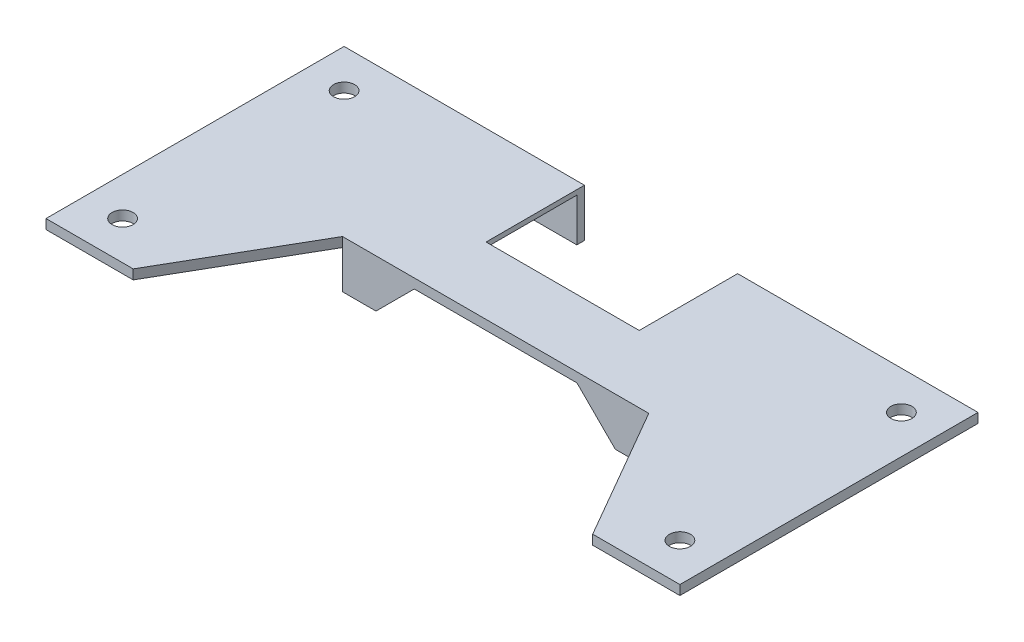
ISO-10303-21;
HEADER;
FILE_DESCRIPTION(('STEP AP214'),'2;1');
FILE_NAME('part.step','',(''),(''),'','','');
FILE_SCHEMA(('AUTOMOTIVE_DESIGN { 1 0 10303 214 1 1 1 1 }'));
ENDSEC;
DATA;
#1=APPLICATION_CONTEXT('core data for automotive mechanical design processes');
#2=APPLICATION_PROTOCOL_DEFINITION('international standard','automotive_design',2000,#1);
#3=PRODUCT_CONTEXT('',#1,'mechanical');
#4=PRODUCT('Part','Part','',(#3));
#5=PRODUCT_RELATED_PRODUCT_CATEGORY('part','',(#4));
#6=PRODUCT_DEFINITION_FORMATION('','',#4);
#7=PRODUCT_DEFINITION_CONTEXT('part definition',#1,'design');
#8=PRODUCT_DEFINITION('design','',#6,#7);
#9=PRODUCT_DEFINITION_SHAPE('','',#8);
#10=(LENGTH_UNIT() NAMED_UNIT(*) SI_UNIT(.MILLI.,.METRE.));
#11=(NAMED_UNIT(*) PLANE_ANGLE_UNIT() SI_UNIT($,.RADIAN.));
#12=(NAMED_UNIT(*) SI_UNIT($,.STERADIAN.) SOLID_ANGLE_UNIT());
#13=UNCERTAINTY_MEASURE_WITH_UNIT(LENGTH_MEASURE(1.E-05),#10,'distance_accuracy_value','');
#14=(GEOMETRIC_REPRESENTATION_CONTEXT(3) GLOBAL_UNCERTAINTY_ASSIGNED_CONTEXT((#13)) GLOBAL_UNIT_ASSIGNED_CONTEXT((#10,
#11,#12)) REPRESENTATION_CONTEXT('',''));
#15=CARTESIAN_POINT('',(0.,0.,0.));
#16=DIRECTION('',(0.,0.,1.));
#17=DIRECTION('',(1.,0.,0.));
#18=AXIS2_PLACEMENT_3D('',#15,#16,#17);
#19=CARTESIAN_POINT('',(8.61002816952043,-4.,0.));
#20=DIRECTION('',(1.,0.,0.));
#21=DIRECTION('',(0.,0.,-1.));
#22=AXIS2_PLACEMENT_3D('',#19,#20,#21);
#23=PLANE('',#22);
#24=DIRECTION('',(0.,0.,-1.));
#25=VECTOR('',#24,1.);
#26=CARTESIAN_POINT('',(8.61002816952043,-4.,0.));
#27=LINE('',#26,#25);
#28=CARTESIAN_POINT('',(8.61002816952043,-4.,8.95537010545894));
#29=VERTEX_POINT('',#28);
#30=CARTESIAN_POINT('',(8.61002816952043,-4.,-8.32462989454106));
#31=VERTEX_POINT('',#30);
#32=EDGE_CURVE('E310',#29,#31,#27,.T.);
#33=ORIENTED_EDGE('',*,*,#32,.T.);
#34=DIRECTION('',(0.,1.,0.));
#35=VECTOR('',#34,1.);
#36=CARTESIAN_POINT('',(8.61002816952043,-12.0399004968967,-8.32462989454106));
#37=LINE('',#36,#35);
#38=CARTESIAN_POINT('',(8.61002816952043,0.,-8.32462989454106));
#39=VERTEX_POINT('',#38);
#40=EDGE_CURVE('E229',#31,#39,#37,.T.);
#41=ORIENTED_EDGE('',*,*,#40,.T.);
#42=DIRECTION('',(0.,0.,1.));
#43=VECTOR('',#42,1.);
#44=CARTESIAN_POINT('',(8.61002816952043,0.,0.));
#45=LINE('',#44,#43);
#46=CARTESIAN_POINT('',(8.61002816952043,0.,8.95537010545894));
#47=VERTEX_POINT('',#46);
#48=EDGE_CURVE('E297',#39,#47,#45,.T.);
#49=ORIENTED_EDGE('',*,*,#48,.T.);
#50=DIRECTION('',(0.,1.,0.));
#51=VECTOR('',#50,1.);
#52=CARTESIAN_POINT('',(8.61002816952043,-4.,8.95537010545894));
#53=LINE('',#52,#51);
#54=EDGE_CURVE('E314',#29,#47,#53,.T.);
#55=ORIENTED_EDGE('',*,*,#54,.F.);
#56=EDGE_LOOP('',(#33,#41,#49,#55));
#57=FACE_BOUND('',#56,.T.);
#58=ADVANCED_FACE('F41',(#57),#23,.T.);
#59=CARTESIAN_POINT('',(-15.3899718304796,-4.,0.));
#60=DIRECTION('',(1.,0.,0.));
#61=DIRECTION('',(0.,0.,-1.));
#62=AXIS2_PLACEMENT_3D('',#59,#60,#61);
#63=PLANE('',#62);
#64=DIRECTION('',(0.,-1.,0.));
#65=VECTOR('',#64,1.);
#66=CARTESIAN_POINT('',(-15.3899718304796,1.,1.95537010545894));
#67=LINE('',#66,#65);
#68=CARTESIAN_POINT('',(-15.3899718304796,1.,1.95537010545894));
#69=VERTEX_POINT('',#68);
#70=CARTESIAN_POINT('',(-15.3899718304796,0.500000000000011,1.95537010545894));
#71=VERTEX_POINT('',#70);
#72=EDGE_CURVE('E329',#69,#71,#67,.T.);
#73=ORIENTED_EDGE('',*,*,#72,.T.);
#74=DIRECTION('',(0.,0.,-1.));
#75=VECTOR('',#74,1.);
#76=CARTESIAN_POINT('',(-15.3899718304796,0.500000000000011,-7.52462989454106));
#77=LINE('',#76,#75);
#78=CARTESIAN_POINT('',(-15.3899718304796,0.500000000000011,-7.52462989454106));
#79=VERTEX_POINT('',#78);
#80=EDGE_CURVE('E426',#71,#79,#77,.T.);
#81=ORIENTED_EDGE('',*,*,#80,.T.);
#82=DIRECTION('',(0.,1.,0.));
#83=VECTOR('',#82,1.);
#84=CARTESIAN_POINT('',(-15.3899718304796,-12.0399004968967,-7.52462989454106));
#85=LINE('',#84,#83);
#86=CARTESIAN_POINT('',(-15.3899718304796,-4.,-7.52462989454106));
#87=VERTEX_POINT('',#86);
#88=EDGE_CURVE('E248',#87,#79,#85,.T.);
#89=ORIENTED_EDGE('',*,*,#88,.F.);
#90=DIRECTION('',(0.,0.,1.));
#91=VECTOR('',#90,1.);
#92=CARTESIAN_POINT('',(-15.3899718304796,-4.,0.));
#93=LINE('',#92,#91);
#94=CARTESIAN_POINT('',(-15.3899718304796,-4.,-8.32462989454106));
#95=VERTEX_POINT('',#94);
#96=EDGE_CURVE('E247',#95,#87,#93,.T.);
#97=ORIENTED_EDGE('',*,*,#96,.F.);
#98=DIRECTION('',(0.,1.,0.));
#99=VECTOR('',#98,1.);
#100=CARTESIAN_POINT('',(-15.3899718304796,-12.0399004968967,-8.32462989454106));
#101=LINE('',#100,#99);
#102=CARTESIAN_POINT('',(-15.3899718304796,1.,-8.32462989454106));
#103=VERTEX_POINT('',#102);
#104=EDGE_CURVE('E242',#95,#103,#101,.T.);
#105=ORIENTED_EDGE('',*,*,#104,.T.);
#106=DIRECTION('',(0.,0.,-1.));
#107=VECTOR('',#106,1.);
#108=CARTESIAN_POINT('',(-15.3899718304796,1.,0.));
#109=LINE('',#108,#107);
#110=EDGE_CURVE('E339',#69,#103,#109,.T.);
#111=ORIENTED_EDGE('',*,*,#110,.F.);
#112=EDGE_LOOP('',(#73,#81,#89,#97,#105,#111));
#113=FACE_BOUND('',#112,.T.);
#114=ADVANCED_FACE('F541',(#113),#63,.T.);
#115=CARTESIAN_POINT('',(-23.3899718304796,1.,0.));
#116=DIRECTION('',(1.,0.,0.));
#117=DIRECTION('',(0.,0.,-1.));
#118=AXIS2_PLACEMENT_3D('',#115,#116,#117);
#119=PLANE('',#118);
#120=DIRECTION('',(0.,0.,1.));
#121=VECTOR('',#120,1.);
#122=CARTESIAN_POINT('',(-23.3899718304796,1.,0.));
#123=LINE('',#122,#121);
#124=CARTESIAN_POINT('',(-23.3899718304796,1.,8.95537010545894));
#125=VERTEX_POINT('',#124);
#126=CARTESIAN_POINT('',(-23.3899718304796,1.,8.95896364490793));
#127=VERTEX_POINT('',#126);
#128=EDGE_CURVE('E358',#125,#127,#123,.T.);
#129=ORIENTED_EDGE('',*,*,#128,.T.);
#130=DIRECTION('',(0.,-1.,0.));
#131=VECTOR('',#130,1.);
#132=CARTESIAN_POINT('',(-23.3899718304796,0.,8.95896364490793));
#133=LINE('',#132,#131);
#134=CARTESIAN_POINT('',(-23.3899718304796,0.,8.95896364490793));
#135=VERTEX_POINT('',#134);
#136=EDGE_CURVE('E448',#127,#135,#133,.T.);
#137=ORIENTED_EDGE('',*,*,#136,.T.);
#138=DIRECTION('',(0.,0.,1.));
#139=VECTOR('',#138,1.);
#140=CARTESIAN_POINT('',(-23.3899718304796,0.,0.));
#141=LINE('',#140,#139);
#142=CARTESIAN_POINT('',(-23.3899718304796,0.,8.95537010545894));
#143=VERTEX_POINT('',#142);
#144=EDGE_CURVE('E381',#143,#135,#141,.T.);
#145=ORIENTED_EDGE('',*,*,#144,.F.);
#146=DIRECTION('',(0.,1.,0.));
#147=VECTOR('',#146,1.);
#148=CARTESIAN_POINT('',(-23.3899718304796,-4.,8.95537010545894));
#149=LINE('',#148,#147);
#150=EDGE_CURVE('E353',#143,#125,#149,.T.);
#151=ORIENTED_EDGE('',*,*,#150,.T.);
#152=EDGE_LOOP('',(#129,#137,#145,#151));
#153=FACE_BOUND('',#152,.T.);
#154=ADVANCED_FACE('F512',(#153),#119,.T.);
#155=CARTESIAN_POINT('',(0.,1.,22.8153701054589));
#156=DIRECTION('',(0.,0.,-1.));
#157=DIRECTION('',(-1.,0.,0.));
#158=AXIS2_PLACEMENT_3D('',#155,#156,#157);
#159=PLANE('',#158);
#160=DIRECTION('',(1.,0.,0.));
#161=VECTOR('',#160,1.);
#162=CARTESIAN_POINT('',(0.,0.,22.8153701054589));
#163=LINE('',#162,#161);
#164=CARTESIAN_POINT('',(-40.4999718304796,0.,22.8153701054589));
#165=VERTEX_POINT('',#164);
#166=CARTESIAN_POINT('',(-31.3899718304796,0.,22.8153701054589));
#167=VERTEX_POINT('',#166);
#168=EDGE_CURVE('E352',#165,#167,#163,.T.);
#169=ORIENTED_EDGE('',*,*,#168,.T.);
#170=DIRECTION('',(0.,1.,0.));
#171=VECTOR('',#170,1.);
#172=CARTESIAN_POINT('',(-31.3899718304796,1.,22.8153701054589));
#173=LINE('',#172,#171);
#174=CARTESIAN_POINT('',(-31.3899718304796,1.,22.8153701054589));
#175=VERTEX_POINT('',#174);
#176=EDGE_CURVE('E455',#167,#175,#173,.T.);
#177=ORIENTED_EDGE('',*,*,#176,.T.);
#178=DIRECTION('',(1.,0.,0.));
#179=VECTOR('',#178,1.);
#180=CARTESIAN_POINT('',(0.,1.,22.8153701054589));
#181=LINE('',#180,#179);
#182=CARTESIAN_POINT('',(-40.4999718304796,1.,22.8153701054589));
#183=VERTEX_POINT('',#182);
#184=EDGE_CURVE('E354',#183,#175,#181,.T.);
#185=ORIENTED_EDGE('',*,*,#184,.F.);
#186=DIRECTION('',(0.,-1.,0.));
#187=VECTOR('',#186,1.);
#188=CARTESIAN_POINT('',(-40.4999718304796,1.,22.8153701054589));
#189=LINE('',#188,#187);
#190=EDGE_CURVE('E377',#183,#165,#189,.T.);
#191=ORIENTED_EDGE('',*,*,#190,.T.);
#192=EDGE_LOOP('',(#169,#177,#185,#191));
#193=FACE_BOUND('',#192,.T.);
#194=ADVANCED_FACE('F563',(#193),#159,.F.);
#195=CARTESIAN_POINT('',(0.,1.,-8.32462989454106));
#196=DIRECTION('',(0.,0.,-1.));
#197=DIRECTION('',(-1.,0.,0.));
#198=AXIS2_PLACEMENT_3D('',#195,#196,#197);
#199=PLANE('',#198);
#200=DIRECTION('',(1.,0.,0.));
#201=VECTOR('',#200,1.);
#202=CARTESIAN_POINT('',(0.,0.,-8.32462989454106));
#203=LINE('',#202,#201);
#204=CARTESIAN_POINT('',(-40.4999718304796,0.,-8.32462989454106));
#205=VERTEX_POINT('',#204);
#206=CARTESIAN_POINT('',(-23.3899718304796,0.,-8.32462989454106));
#207=VERTEX_POINT('',#206);
#208=EDGE_CURVE('E385',#205,#207,#203,.T.);
#209=ORIENTED_EDGE('',*,*,#208,.F.);
#210=DIRECTION('',(0.,-1.,0.));
#211=VECTOR('',#210,1.);
#212=CARTESIAN_POINT('',(-40.4999718304796,1.,-8.32462989454106));
#213=LINE('',#212,#211);
#214=CARTESIAN_POINT('',(-40.4999718304796,1.,-8.32462989454106));
#215=VERTEX_POINT('',#214);
#216=EDGE_CURVE('E401',#215,#205,#213,.T.);
#217=ORIENTED_EDGE('',*,*,#216,.F.);
#218=DIRECTION('',(1.,0.,0.));
#219=VECTOR('',#218,1.);
#220=CARTESIAN_POINT('',(0.,1.,-8.32462989454106));
#221=LINE('',#220,#219);
#222=EDGE_CURVE('E363',#215,#103,#221,.T.);
#223=ORIENTED_EDGE('',*,*,#222,.T.);
#224=ORIENTED_EDGE('',*,*,#104,.F.);
#225=DIRECTION('',(1.,0.,0.));
#226=VECTOR('',#225,1.);
#227=CARTESIAN_POINT('',(0.,-4.,-8.32462989454106));
#228=LINE('',#227,#226);
#229=CARTESIAN_POINT('',(-23.3899718304796,-4.,-8.32462989454106));
#230=VERTEX_POINT('',#229);
#231=EDGE_CURVE('E252',#230,#95,#228,.T.);
#232=ORIENTED_EDGE('',*,*,#231,.F.);
#233=DIRECTION('',(0.,1.,0.));
#234=VECTOR('',#233,1.);
#235=CARTESIAN_POINT('',(-23.3899718304796,-12.0399004968967,-8.32462989454106));
#236=LINE('',#235,#234);
#237=EDGE_CURVE('E256',#230,#207,#236,.T.);
#238=ORIENTED_EDGE('',*,*,#237,.T.);
#239=EDGE_LOOP('',(#209,#217,#223,#224,#232,#238));
#240=FACE_BOUND('',#239,.T.);
#241=ADVANCED_FACE('F532',(#240),#199,.T.);
#242=CARTESIAN_POINT('',(-36.4999718304796,1.,18.8153701054589));
#243=DIRECTION('',(0.,-1.,0.));
#244=DIRECTION('',(0.,0.,-1.));
#245=AXIS2_PLACEMENT_3D('',#242,#243,#244);
#246=CYLINDRICAL_SURFACE('',#245,1.1);
#247=CARTESIAN_POINT('',(-36.4999718304796,1.,18.8153701054589));
#248=DIRECTION('',(0.,1.,0.));
#249=DIRECTION('',(0.,0.,1.));
#250=AXIS2_PLACEMENT_3D('',#247,#248,#249);
#251=CIRCLE('',#250,1.1);
#252=CARTESIAN_POINT('',(-36.4999718304796,1.,19.9153701054589));
#253=VERTEX_POINT('',#252);
#254=EDGE_CURVE('E369',#253,#253,#251,.T.);
#255=ORIENTED_EDGE('',*,*,#254,.T.);
#256=EDGE_LOOP('',(#255));
#257=FACE_BOUND('',#256,.T.);
#258=CARTESIAN_POINT('',(-36.4999718304796,0.,18.8153701054589));
#259=DIRECTION('',(0.,1.,0.));
#260=DIRECTION('',(0.,0.,1.));
#261=AXIS2_PLACEMENT_3D('',#258,#259,#260);
#262=CIRCLE('',#261,1.1);
#263=CARTESIAN_POINT('',(-36.4999718304796,0.,19.9153701054589));
#264=VERTEX_POINT('',#263);
#265=EDGE_CURVE('E391',#264,#264,#262,.T.);
#266=ORIENTED_EDGE('',*,*,#265,.F.);
#267=EDGE_LOOP('',(#266));
#268=FACE_BOUND('',#267,.T.);
#269=ADVANCED_FACE('F570',(#257,#268),#246,.F.);
#270=CARTESIAN_POINT('',(-40.4999718304796,1.,0.));
#271=DIRECTION('',(1.,0.,0.));
#272=DIRECTION('',(0.,0.,-1.));
#273=AXIS2_PLACEMENT_3D('',#270,#271,#272);
#274=PLANE('',#273);
#275=DIRECTION('',(0.,0.,1.));
#276=VECTOR('',#275,1.);
#277=CARTESIAN_POINT('',(-40.4999718304796,0.,0.));
#278=LINE('',#277,#276);
#279=EDGE_CURVE('E388',#205,#165,#278,.T.);
#280=ORIENTED_EDGE('',*,*,#279,.T.);
#281=ORIENTED_EDGE('',*,*,#190,.F.);
#282=DIRECTION('',(0.,0.,1.));
#283=VECTOR('',#282,1.);
#284=CARTESIAN_POINT('',(-40.4999718304796,1.,0.));
#285=LINE('',#284,#283);
#286=EDGE_CURVE('E366',#215,#183,#285,.T.);
#287=ORIENTED_EDGE('',*,*,#286,.F.);
#288=ORIENTED_EDGE('',*,*,#216,.T.);
#289=EDGE_LOOP('',(#280,#281,#287,#288));
#290=FACE_BOUND('',#289,.T.);
#291=ADVANCED_FACE('F561',(#290),#274,.F.);
#292=CARTESIAN_POINT('',(-36.4999718304796,1.,-4.32462989454106));
#293=DIRECTION('',(0.,-1.,0.));
#294=DIRECTION('',(0.,0.,-1.));
#295=AXIS2_PLACEMENT_3D('',#292,#293,#294);
#296=CYLINDRICAL_SURFACE('',#295,1.1);
#297=CARTESIAN_POINT('',(-36.4999718304796,1.,-4.32462989454106));
#298=DIRECTION('',(0.,1.,0.));
#299=DIRECTION('',(0.,0.,1.));
#300=AXIS2_PLACEMENT_3D('',#297,#298,#299);
#301=CIRCLE('',#300,1.1);
#302=CARTESIAN_POINT('',(-36.4999718304796,1.,-3.22462989454106));
#303=VERTEX_POINT('',#302);
#304=EDGE_CURVE('E373',#303,#303,#301,.T.);
#305=ORIENTED_EDGE('',*,*,#304,.T.);
#306=EDGE_LOOP('',(#305));
#307=FACE_BOUND('',#306,.T.);
#308=CARTESIAN_POINT('',(-36.4999718304796,0.,-4.32462989454106));
#309=DIRECTION('',(0.,1.,0.));
#310=DIRECTION('',(0.,0.,1.));
#311=AXIS2_PLACEMENT_3D('',#308,#309,#310);
#312=CIRCLE('',#311,1.1);
#313=CARTESIAN_POINT('',(-36.4999718304796,0.,-3.22462989454106));
#314=VERTEX_POINT('',#313);
#315=EDGE_CURVE('E359',#314,#314,#312,.T.);
#316=ORIENTED_EDGE('',*,*,#315,.F.);
#317=EDGE_LOOP('',(#316));
#318=FACE_BOUND('',#317,.T.);
#319=ADVANCED_FACE('F595',(#307,#318),#296,.F.);
#320=CARTESIAN_POINT('',(0.,1.,0.));
#321=DIRECTION('',(0.,1.,0.));
#322=DIRECTION('',(0.,0.,1.));
#323=AXIS2_PLACEMENT_3D('',#320,#321,#322);
#324=PLANE('',#323);
#325=DIRECTION('',(0.,0.,1.));
#326=VECTOR('',#325,1.);
#327=CARTESIAN_POINT('',(8.61002816952043,1.,0.));
#328=LINE('',#327,#326);
#329=CARTESIAN_POINT('',(8.61002816952043,1.,8.95537010545894));
#330=VERTEX_POINT('',#329);
#331=CARTESIAN_POINT('',(8.61002816952043,1.,8.95896364490793));
#332=VERTEX_POINT('',#331);
#333=EDGE_CURVE('E219',#330,#332,#328,.T.);
#334=ORIENTED_EDGE('',*,*,#333,.T.);
#335=DIRECTION('',(-0.500000000000001,0.,-0.866025403784438));
#336=VECTOR('',#335,1.);
#337=CARTESIAN_POINT('',(2.57817607310457,1.,-1.48851064982518));
#338=LINE('',#337,#336);
#339=CARTESIAN_POINT('',(16.6100281695204,1.,22.8153701054589));
#340=VERTEX_POINT('',#339);
#341=EDGE_CURVE('E11',#332,#340,#338,.F.);
#342=ORIENTED_EDGE('',*,*,#341,.T.);
#343=DIRECTION('',(1.,0.,0.));
#344=VECTOR('',#343,1.);
#345=CARTESIAN_POINT('',(0.,1.,22.8153701054589));
#346=LINE('',#345,#344);
#347=CARTESIAN_POINT('',(25.7200281695204,1.,22.8153701054589));
#348=VERTEX_POINT('',#347);
#349=EDGE_CURVE('E276',#340,#348,#346,.T.);
#350=ORIENTED_EDGE('',*,*,#349,.T.);
#351=DIRECTION('',(0.,0.,1.));
#352=VECTOR('',#351,1.);
#353=CARTESIAN_POINT('',(25.7200281695204,1.,0.));
#354=LINE('',#353,#352);
#355=CARTESIAN_POINT('',(25.7200281695204,1.,-8.32462989454106));
#356=VERTEX_POINT('',#355);
#357=EDGE_CURVE('E216',#356,#348,#354,.T.);
#358=ORIENTED_EDGE('',*,*,#357,.F.);
#359=DIRECTION('',(1.,0.,0.));
#360=VECTOR('',#359,1.);
#361=CARTESIAN_POINT('',(0.,1.,-8.32462989454106));
#362=LINE('',#361,#360);
#363=CARTESIAN_POINT('',(0.610028169520424,1.,-8.32462989454106));
#364=VERTEX_POINT('',#363);
#365=EDGE_CURVE('E212',#364,#356,#362,.T.);
#366=ORIENTED_EDGE('',*,*,#365,.F.);
#367=DIRECTION('',(0.,0.,-1.));
#368=VECTOR('',#367,1.);
#369=CARTESIAN_POINT('',(0.610028169520424,1.,0.));
#370=LINE('',#369,#368);
#371=CARTESIAN_POINT('',(0.610028169520424,1.,1.95537010545894));
#372=VERTEX_POINT('',#371);
#373=EDGE_CURVE('E195',#372,#364,#370,.T.);
#374=ORIENTED_EDGE('',*,*,#373,.F.);
#375=DIRECTION('',(-1.,0.,0.));
#376=VECTOR('',#375,1.);
#377=CARTESIAN_POINT('',(0.,1.,1.95537010545894));
#378=LINE('',#377,#376);
#379=EDGE_CURVE('E319',#372,#69,#378,.T.);
#380=ORIENTED_EDGE('',*,*,#379,.T.);
#381=ORIENTED_EDGE('',*,*,#110,.T.);
#382=ORIENTED_EDGE('',*,*,#222,.F.);
#383=ORIENTED_EDGE('',*,*,#286,.T.);
#384=ORIENTED_EDGE('',*,*,#184,.T.);
#385=DIRECTION('',(0.500000000000001,0.,-0.866025403784438));
#386=VECTOR('',#385,1.);
#387=CARTESIAN_POINT('',(-13.6631338188239,1.,-7.88841398827188));
#388=LINE('',#387,#386);
#389=EDGE_CURVE('E458',#175,#127,#388,.T.);
#390=ORIENTED_EDGE('',*,*,#389,.T.);
#391=ORIENTED_EDGE('',*,*,#128,.F.);
#392=DIRECTION('',(1.,0.,0.));
#393=VECTOR('',#392,1.);
#394=CARTESIAN_POINT('',(0.,1.,8.95537010545894));
#395=LINE('',#394,#393);
#396=EDGE_CURVE('E333',#125,#330,#395,.T.);
#397=ORIENTED_EDGE('',*,*,#396,.T.);
#398=EDGE_LOOP('',(#334,#342,#350,#358,#366,#374,#380,#381,#382,#383,#384,#390,#391,#397));
#399=FACE_BOUND('',#398,.T.);
#400=ORIENTED_EDGE('',*,*,#254,.F.);
#401=EDGE_LOOP('',(#400));
#402=FACE_BOUND('',#401,.T.);
#403=ORIENTED_EDGE('',*,*,#304,.F.);
#404=EDGE_LOOP('',(#403));
#405=FACE_BOUND('',#404,.T.);
#406=CARTESIAN_POINT('',(21.7200281695204,1.,-4.32462989454106));
#407=DIRECTION('',(0.,1.,0.));
#408=DIRECTION('',(0.,0.,1.));
#409=AXIS2_PLACEMENT_3D('',#406,#407,#408);
#410=CIRCLE('',#409,1.1);
#411=CARTESIAN_POINT('',(21.7200281695204,1.,-3.22462989454106));
#412=VERTEX_POINT('',#411);
#413=EDGE_CURVE('E266',#412,#412,#410,.T.);
#414=ORIENTED_EDGE('',*,*,#413,.F.);
#415=EDGE_LOOP('',(#414));
#416=FACE_BOUND('',#415,.T.);
#417=CARTESIAN_POINT('',(21.7200281695204,1.,18.8153701054589));
#418=DIRECTION('',(0.,1.,0.));
#419=DIRECTION('',(0.,0.,1.));
#420=AXIS2_PLACEMENT_3D('',#417,#418,#419);
#421=CIRCLE('',#420,1.1);
#422=CARTESIAN_POINT('',(21.7200281695204,1.,19.9153701054589));
#423=VERTEX_POINT('',#422);
#424=EDGE_CURVE('E220',#423,#423,#421,.T.);
#425=ORIENTED_EDGE('',*,*,#424,.F.);
#426=EDGE_LOOP('',(#425));
#427=FACE_BOUND('',#426,.T.);
#428=ADVANCED_FACE('F213',(#399,#402,#405,#416,#427),#324,.T.);
#429=CARTESIAN_POINT('',(0.,0.,0.));
#430=DIRECTION('',(0.,1.,0.));
#431=DIRECTION('',(0.,0.,1.));
#432=AXIS2_PLACEMENT_3D('',#429,#430,#431);
#433=PLANE('',#432);
#434=ORIENTED_EDGE('',*,*,#144,.T.);
#435=DIRECTION('',(-0.500000000000001,0.,0.866025403784438));
#436=VECTOR('',#435,1.);
#437=CARTESIAN_POINT('',(-23.3899718304796,0.,8.95896364490793));
#438=LINE('',#437,#436);
#439=EDGE_CURVE('E452',#135,#167,#438,.T.);
#440=ORIENTED_EDGE('',*,*,#439,.T.);
#441=ORIENTED_EDGE('',*,*,#168,.F.);
#442=ORIENTED_EDGE('',*,*,#279,.F.);
#443=ORIENTED_EDGE('',*,*,#208,.T.);
#444=EDGE_CURVE('E382',#207,#143,#141,.T.);
#445=ORIENTED_EDGE('',*,*,#444,.T.);
#446=EDGE_LOOP('',(#434,#440,#441,#442,#443,#445));
#447=FACE_BOUND('',#446,.T.);
#448=ORIENTED_EDGE('',*,*,#265,.T.);
#449=EDGE_LOOP('',(#448));
#450=FACE_BOUND('',#449,.T.);
#451=ORIENTED_EDGE('',*,*,#315,.T.);
#452=EDGE_LOOP('',(#451));
#453=FACE_BOUND('',#452,.T.);
#454=ADVANCED_FACE('F520',(#447,#450,#453),#433,.F.);
#455=CARTESIAN_POINT('',(0.,-4.,8.95537010545894));
#456=DIRECTION('',(0.,0.,1.));
#457=DIRECTION('',(1.,0.,0.));
#458=AXIS2_PLACEMENT_3D('',#455,#456,#457);
#459=PLANE('',#458);
#460=DIRECTION('',(0.707106781186549,0.707106781186546,0.));
#461=VECTOR('',#460,1.);
#462=CARTESIAN_POINT('',(-9.94498591523976,5.94498591523979,8.95537010545894));
#463=LINE('',#462,#461);
#464=CARTESIAN_POINT('',(-19.8899718304796,-4.,8.95537010545894));
#465=VERTEX_POINT('',#464);
#466=CARTESIAN_POINT('',(-15.8899718304796,0.,8.95537010545894));
#467=VERTEX_POINT('',#466);
#468=EDGE_CURVE('E437',#465,#467,#463,.T.);
#469=ORIENTED_EDGE('',*,*,#468,.T.);
#470=DIRECTION('',(-1.,0.,0.));
#471=VECTOR('',#470,1.);
#472=CARTESIAN_POINT('',(0.,0.,8.95537010545894));
#473=LINE('',#472,#471);
#474=CARTESIAN_POINT('',(1.11002816952045,0.,8.95537010545894));
#475=VERTEX_POINT('',#474);
#476=EDGE_CURVE('E322',#475,#467,#473,.T.);
#477=ORIENTED_EDGE('',*,*,#476,.F.);
#478=DIRECTION('',(-0.707106781186546,0.707106781186549,0.));
#479=VECTOR('',#478,1.);
#480=CARTESIAN_POINT('',(2.55501408476023,-1.44498591523978,8.95537010545894));
#481=LINE('',#480,#479);
#482=CARTESIAN_POINT('',(5.11002816952043,-4.,8.95537010545894));
#483=VERTEX_POINT('',#482);
#484=EDGE_CURVE('E415',#475,#483,#481,.F.);
#485=ORIENTED_EDGE('',*,*,#484,.T.);
#486=DIRECTION('',(1.,0.,0.));
#487=VECTOR('',#486,1.);
#488=CARTESIAN_POINT('',(0.,-4.,8.95537010545894));
#489=LINE('',#488,#487);
#490=EDGE_CURVE('E207',#483,#29,#489,.T.);
#491=ORIENTED_EDGE('',*,*,#490,.T.);
#492=ORIENTED_EDGE('',*,*,#54,.T.);
#493=EDGE_CURVE('E312',#47,#330,#53,.T.);
#494=ORIENTED_EDGE('',*,*,#493,.T.);
#495=ORIENTED_EDGE('',*,*,#396,.F.);
#496=ORIENTED_EDGE('',*,*,#150,.F.);
#497=CARTESIAN_POINT('',(-23.3899718304796,-4.,8.95537010545894));
#498=VERTEX_POINT('',#497);
#499=EDGE_CURVE('E342',#498,#143,#149,.T.);
#500=ORIENTED_EDGE('',*,*,#499,.F.);
#501=DIRECTION('',(1.,0.,0.));
#502=VECTOR('',#501,1.);
#503=CARTESIAN_POINT('',(0.,-4.,8.95537010545894));
#504=LINE('',#503,#502);
#505=EDGE_CURVE('E334',#498,#465,#504,.T.);
#506=ORIENTED_EDGE('',*,*,#505,.T.);
#507=EDGE_LOOP('',(#469,#477,#485,#491,#492,#494,#495,#496,#500,#506));
#508=FACE_BOUND('',#507,.T.);
#509=ADVANCED_FACE('F493',(#508),#459,.T.);
#510=CARTESIAN_POINT('',(-23.3899718304796,-4.,0.));
#511=DIRECTION('',(1.,0.,0.));
#512=DIRECTION('',(0.,0.,-1.));
#513=AXIS2_PLACEMENT_3D('',#510,#511,#512);
#514=PLANE('',#513);
#515=ORIENTED_EDGE('',*,*,#499,.T.);
#516=ORIENTED_EDGE('',*,*,#444,.F.);
#517=ORIENTED_EDGE('',*,*,#237,.F.);
#518=DIRECTION('',(0.,0.,-1.));
#519=VECTOR('',#518,1.);
#520=CARTESIAN_POINT('',(-23.3899718304796,-4.,0.));
#521=LINE('',#520,#519);
#522=EDGE_CURVE('E338',#498,#230,#521,.T.);
#523=ORIENTED_EDGE('',*,*,#522,.F.);
#524=EDGE_LOOP('',(#515,#516,#517,#523));
#525=FACE_BOUND('',#524,.T.);
#526=ADVANCED_FACE('F528',(#525),#514,.F.);
#527=CARTESIAN_POINT('',(0.,-4.,0.));
#528=DIRECTION('',(0.,1.,0.));
#529=DIRECTION('',(0.,0.,1.));
#530=AXIS2_PLACEMENT_3D('',#527,#528,#529);
#531=PLANE('',#530);
#532=ORIENTED_EDGE('',*,*,#522,.T.);
#533=ORIENTED_EDGE('',*,*,#231,.T.);
#534=ORIENTED_EDGE('',*,*,#96,.T.);
#535=DIRECTION('',(1.,0.,0.));
#536=VECTOR('',#535,1.);
#537=CARTESIAN_POINT('',(0.,-4.,-7.52462989454106));
#538=LINE('',#537,#536);
#539=CARTESIAN_POINT('',(-19.8899718304796,-4.,-7.52462989454106));
#540=VERTEX_POINT('',#539);
#541=EDGE_CURVE('E244',#540,#87,#538,.T.);
#542=ORIENTED_EDGE('',*,*,#541,.F.);
#543=DIRECTION('',(0.,0.,1.));
#544=VECTOR('',#543,1.);
#545=CARTESIAN_POINT('',(-19.8899718304796,-4.,8.95537010545894));
#546=LINE('',#545,#544);
#547=EDGE_CURVE('E434',#540,#465,#546,.T.);
#548=ORIENTED_EDGE('',*,*,#547,.T.);
#549=ORIENTED_EDGE('',*,*,#505,.F.);
#550=EDGE_LOOP('',(#532,#533,#534,#542,#548,#549));
#551=FACE_BOUND('',#550,.T.);
#552=ADVANCED_FACE('F536',(#551),#531,.F.);
#553=CARTESIAN_POINT('',(0.,1.,1.95537010545894));
#554=DIRECTION('',(0.,0.,1.));
#555=DIRECTION('',(1.,0.,0.));
#556=AXIS2_PLACEMENT_3D('',#553,#554,#555);
#557=PLANE('',#556);
#558=DIRECTION('',(-1.,0.,0.));
#559=VECTOR('',#558,1.);
#560=CARTESIAN_POINT('',(0.,0.,1.95537010545894));
#561=LINE('',#560,#559);
#562=CARTESIAN_POINT('',(1.11002816952045,0.,1.95537010545894));
#563=VERTEX_POINT('',#562);
#564=CARTESIAN_POINT('',(-15.8899718304796,0.,1.95537010545894));
#565=VERTEX_POINT('',#564);
#566=EDGE_CURVE('E318',#563,#565,#561,.T.);
#567=ORIENTED_EDGE('',*,*,#566,.T.);
#568=DIRECTION('',(0.707106781186549,0.707106781186546,0.));
#569=VECTOR('',#568,1.);
#570=CARTESIAN_POINT('',(-7.44498591523976,8.44498591523979,1.95537010545894));
#571=LINE('',#570,#569);
#572=EDGE_CURVE('E445',#565,#71,#571,.T.);
#573=ORIENTED_EDGE('',*,*,#572,.T.);
#574=ORIENTED_EDGE('',*,*,#72,.F.);
#575=ORIENTED_EDGE('',*,*,#379,.F.);
#576=DIRECTION('',(0.,-1.,0.));
#577=VECTOR('',#576,1.);
#578=CARTESIAN_POINT('',(0.610028169520424,1.,1.95537010545894));
#579=LINE('',#578,#577);
#580=CARTESIAN_POINT('',(0.610028169520424,0.500000000000026,1.95537010545894));
#581=VERTEX_POINT('',#580);
#582=EDGE_CURVE('E203',#372,#581,#579,.T.);
#583=ORIENTED_EDGE('',*,*,#582,.T.);
#584=DIRECTION('',(-0.707106781186546,0.707106781186549,0.));
#585=VECTOR('',#584,1.);
#586=CARTESIAN_POINT('',(0.0550140847602257,1.05501408476023,1.95537010545894));
#587=LINE('',#586,#585);
#588=EDGE_CURVE('E418',#581,#563,#587,.F.);
#589=ORIENTED_EDGE('',*,*,#588,.T.);
#590=EDGE_LOOP('',(#567,#573,#574,#575,#583,#589));
#591=FACE_BOUND('',#590,.T.);
#592=ADVANCED_FACE('F555',(#591),#557,.F.);
#593=CARTESIAN_POINT('',(0.,0.,0.));
#594=DIRECTION('',(0.,1.,0.));
#595=DIRECTION('',(0.,0.,1.));
#596=AXIS2_PLACEMENT_3D('',#593,#594,#595);
#597=PLANE('',#596);
#598=ORIENTED_EDGE('',*,*,#566,.F.);
#599=DIRECTION('',(0.,0.,-1.));
#600=VECTOR('',#599,1.);
#601=CARTESIAN_POINT('',(1.11002816952045,0.,0.));
#602=LINE('',#601,#600);
#603=EDGE_CURVE('E422',#563,#475,#602,.F.);
#604=ORIENTED_EDGE('',*,*,#603,.T.);
#605=ORIENTED_EDGE('',*,*,#476,.T.);
#606=DIRECTION('',(0.,0.,-1.));
#607=VECTOR('',#606,1.);
#608=CARTESIAN_POINT('',(-15.8899718304796,0.,0.));
#609=LINE('',#608,#607);
#610=EDGE_CURVE('E441',#467,#565,#609,.T.);
#611=ORIENTED_EDGE('',*,*,#610,.T.);
#612=EDGE_LOOP('',(#598,#604,#605,#611));
#613=FACE_BOUND('',#612,.T.);
#614=ADVANCED_FACE('F552',(#613),#597,.F.);
#615=CARTESIAN_POINT('',(0.610028169520424,-4.,0.));
#616=DIRECTION('',(1.,0.,0.));
#617=DIRECTION('',(0.,0.,-1.));
#618=AXIS2_PLACEMENT_3D('',#615,#616,#617);
#619=PLANE('',#618);
#620=ORIENTED_EDGE('',*,*,#373,.T.);
#621=DIRECTION('',(0.,1.,0.));
#622=VECTOR('',#621,1.);
#623=CARTESIAN_POINT('',(0.610028169520424,-12.0399004968967,-8.32462989454106));
#624=LINE('',#623,#622);
#625=CARTESIAN_POINT('',(0.610028169520424,-4.,-8.32462989454106));
#626=VERTEX_POINT('',#625);
#627=EDGE_CURVE('E200',#626,#364,#624,.T.);
#628=ORIENTED_EDGE('',*,*,#627,.F.);
#629=DIRECTION('',(0.,0.,1.));
#630=VECTOR('',#629,1.);
#631=CARTESIAN_POINT('',(0.610028169520424,-4.,0.));
#632=LINE('',#631,#630);
#633=CARTESIAN_POINT('',(0.610028169520424,-4.,-7.52462989454106));
#634=VERTEX_POINT('',#633);
#635=EDGE_CURVE('E234',#626,#634,#632,.T.);
#636=ORIENTED_EDGE('',*,*,#635,.T.);
#637=DIRECTION('',(0.,1.,0.));
#638=VECTOR('',#637,1.);
#639=CARTESIAN_POINT('',(0.610028169520425,-12.0399004968967,-7.52462989454106));
#640=LINE('',#639,#638);
#641=CARTESIAN_POINT('',(0.610028169520425,0.500000000000022,-7.52462989454106));
#642=VERTEX_POINT('',#641);
#643=EDGE_CURVE('E228',#634,#642,#640,.T.);
#644=ORIENTED_EDGE('',*,*,#643,.T.);
#645=DIRECTION('',(0.,0.,1.));
#646=VECTOR('',#645,1.);
#647=CARTESIAN_POINT('',(0.610028169520424,0.500000000000026,0.));
#648=LINE('',#647,#646);
#649=EDGE_CURVE('E412',#642,#581,#648,.T.);
#650=ORIENTED_EDGE('',*,*,#649,.T.);
#651=ORIENTED_EDGE('',*,*,#582,.F.);
#652=EDGE_LOOP('',(#620,#628,#636,#644,#650,#651));
#653=FACE_BOUND('',#652,.T.);
#654=ADVANCED_FACE('F197',(#653),#619,.F.);
#655=CARTESIAN_POINT('',(0.,-4.,0.));
#656=DIRECTION('',(0.,1.,0.));
#657=DIRECTION('',(0.,0.,1.));
#658=AXIS2_PLACEMENT_3D('',#655,#656,#657);
#659=PLANE('',#658);
#660=ORIENTED_EDGE('',*,*,#490,.F.);
#661=DIRECTION('',(0.,0.,-1.));
#662=VECTOR('',#661,1.);
#663=CARTESIAN_POINT('',(5.11002816952043,-4.,0.));
#664=LINE('',#663,#662);
#665=CARTESIAN_POINT('',(5.11002816952043,-4.,-7.52462989454107));
#666=VERTEX_POINT('',#665);
#667=EDGE_CURVE('E404',#483,#666,#664,.T.);
#668=ORIENTED_EDGE('',*,*,#667,.T.);
#669=DIRECTION('',(1.,0.,0.));
#670=VECTOR('',#669,1.);
#671=CARTESIAN_POINT('',(0.,-4.,-7.52462989454106));
#672=LINE('',#671,#670);
#673=EDGE_CURVE('E243',#634,#666,#672,.T.);
#674=ORIENTED_EDGE('',*,*,#673,.F.);
#675=ORIENTED_EDGE('',*,*,#635,.F.);
#676=DIRECTION('',(1.,0.,0.));
#677=VECTOR('',#676,1.);
#678=CARTESIAN_POINT('',(0.,-4.,-8.32462989454106));
#679=LINE('',#678,#677);
#680=EDGE_CURVE('E226',#626,#31,#679,.T.);
#681=ORIENTED_EDGE('',*,*,#680,.T.);
#682=ORIENTED_EDGE('',*,*,#32,.F.);
#683=EDGE_LOOP('',(#660,#668,#674,#675,#681,#682));
#684=FACE_BOUND('',#683,.T.);
#685=ADVANCED_FACE('F489',(#684),#659,.F.);
#686=CARTESIAN_POINT('',(0.,1.,-8.32462989454106));
#687=DIRECTION('',(0.,0.,-1.));
#688=DIRECTION('',(-1.,0.,0.));
#689=AXIS2_PLACEMENT_3D('',#686,#687,#688);
#690=PLANE('',#689);
#691=DIRECTION('',(1.,0.,0.));
#692=VECTOR('',#691,1.);
#693=CARTESIAN_POINT('',(0.,0.,-8.32462989454106));
#694=LINE('',#693,#692);
#695=CARTESIAN_POINT('',(25.7200281695204,0.,-8.32462989454106));
#696=VERTEX_POINT('',#695);
#697=EDGE_CURVE('E289',#39,#696,#694,.T.);
#698=ORIENTED_EDGE('',*,*,#697,.F.);
#699=ORIENTED_EDGE('',*,*,#40,.F.);
#700=ORIENTED_EDGE('',*,*,#680,.F.);
#701=ORIENTED_EDGE('',*,*,#627,.T.);
#702=ORIENTED_EDGE('',*,*,#365,.T.);
#703=DIRECTION('',(0.,-1.,0.));
#704=VECTOR('',#703,1.);
#705=CARTESIAN_POINT('',(25.7200281695204,1.,-8.32462989454106));
#706=LINE('',#705,#704);
#707=EDGE_CURVE('E281',#356,#696,#706,.T.);
#708=ORIENTED_EDGE('',*,*,#707,.T.);
#709=EDGE_LOOP('',(#698,#699,#700,#701,#702,#708));
#710=FACE_BOUND('',#709,.T.);
#711=ADVANCED_FACE('F223',(#710),#690,.T.);
#712=CARTESIAN_POINT('',(8.61002816952043,1.,0.));
#713=DIRECTION('',(1.,0.,0.));
#714=DIRECTION('',(0.,0.,-1.));
#715=AXIS2_PLACEMENT_3D('',#712,#713,#714);
#716=PLANE('',#715);
#717=CARTESIAN_POINT('',(8.61002816952043,0.,8.95896364490793));
#718=VERTEX_POINT('',#717);
#719=EDGE_CURVE('E293',#47,#718,#45,.T.);
#720=ORIENTED_EDGE('',*,*,#719,.T.);
#721=DIRECTION('',(0.,1.,0.));
#722=VECTOR('',#721,1.);
#723=CARTESIAN_POINT('',(8.61002816952043,1.,8.95896364490793));
#724=LINE('',#723,#722);
#725=EDGE_CURVE('E50',#718,#332,#724,.T.);
#726=ORIENTED_EDGE('',*,*,#725,.T.);
#727=ORIENTED_EDGE('',*,*,#333,.F.);
#728=ORIENTED_EDGE('',*,*,#493,.F.);
#729=EDGE_LOOP('',(#720,#726,#727,#728));
#730=FACE_BOUND('',#729,.T.);
#731=ADVANCED_FACE('F508',(#730),#716,.F.);
#732=CARTESIAN_POINT('',(0.,1.,22.8153701054589));
#733=DIRECTION('',(0.,0.,-1.));
#734=DIRECTION('',(-1.,0.,0.));
#735=AXIS2_PLACEMENT_3D('',#732,#733,#734);
#736=PLANE('',#735);
#737=ORIENTED_EDGE('',*,*,#349,.F.);
#738=DIRECTION('',(0.,-1.,0.));
#739=VECTOR('',#738,1.);
#740=CARTESIAN_POINT('',(16.6100281695204,1.,22.8153701054589));
#741=LINE('',#740,#739);
#742=CARTESIAN_POINT('',(16.6100281695204,0.,22.8153701054589));
#743=VERTEX_POINT('',#742);
#744=EDGE_CURVE('E461',#340,#743,#741,.T.);
#745=ORIENTED_EDGE('',*,*,#744,.T.);
#746=DIRECTION('',(1.,0.,0.));
#747=VECTOR('',#746,1.);
#748=CARTESIAN_POINT('',(0.,0.,22.8153701054589));
#749=LINE('',#748,#747);
#750=CARTESIAN_POINT('',(25.7200281695204,0.,22.8153701054589));
#751=VERTEX_POINT('',#750);
#752=EDGE_CURVE('E296',#743,#751,#749,.T.);
#753=ORIENTED_EDGE('',*,*,#752,.T.);
#754=DIRECTION('',(0.,-1.,0.));
#755=VECTOR('',#754,1.);
#756=CARTESIAN_POINT('',(25.7200281695204,1.,22.8153701054589));
#757=LINE('',#756,#755);
#758=EDGE_CURVE('E208',#348,#751,#757,.T.);
#759=ORIENTED_EDGE('',*,*,#758,.F.);
#760=EDGE_LOOP('',(#737,#745,#753,#759));
#761=FACE_BOUND('',#760,.T.);
#762=ADVANCED_FACE('F503',(#761),#736,.F.);
#763=CARTESIAN_POINT('',(21.7200281695204,1.,18.8153701054589));
#764=DIRECTION('',(0.,-1.,0.));
#765=DIRECTION('',(0.,0.,-1.));
#766=AXIS2_PLACEMENT_3D('',#763,#764,#765);
#767=CYLINDRICAL_SURFACE('',#766,1.1);
#768=ORIENTED_EDGE('',*,*,#424,.T.);
#769=EDGE_LOOP('',(#768));
#770=FACE_BOUND('',#769,.T.);
#771=CARTESIAN_POINT('',(21.7200281695204,0.,18.8153701054589));
#772=DIRECTION('',(0.,1.,0.));
#773=DIRECTION('',(0.,0.,1.));
#774=AXIS2_PLACEMENT_3D('',#771,#772,#773);
#775=CIRCLE('',#774,1.1);
#776=CARTESIAN_POINT('',(21.7200281695204,0.,19.9153701054589));
#777=VERTEX_POINT('',#776);
#778=EDGE_CURVE('E285',#777,#777,#775,.T.);
#779=ORIENTED_EDGE('',*,*,#778,.F.);
#780=EDGE_LOOP('',(#779));
#781=FACE_BOUND('',#780,.T.);
#782=ADVANCED_FACE('F674',(#770,#781),#767,.F.);
#783=CARTESIAN_POINT('',(21.7200281695204,1.,-4.32462989454106));
#784=DIRECTION('',(0.,-1.,0.));
#785=DIRECTION('',(0.,0.,-1.));
#786=AXIS2_PLACEMENT_3D('',#783,#784,#785);
#787=CYLINDRICAL_SURFACE('',#786,1.1);
#788=ORIENTED_EDGE('',*,*,#413,.T.);
#789=EDGE_LOOP('',(#788));
#790=FACE_BOUND('',#789,.T.);
#791=CARTESIAN_POINT('',(21.7200281695204,0.,-4.32462989454106));
#792=DIRECTION('',(0.,1.,0.));
#793=DIRECTION('',(0.,0.,1.));
#794=AXIS2_PLACEMENT_3D('',#791,#792,#793);
#795=CIRCLE('',#794,1.1);
#796=CARTESIAN_POINT('',(21.7200281695204,0.,-3.22462989454106));
#797=VERTEX_POINT('',#796);
#798=EDGE_CURVE('E265',#797,#797,#795,.T.);
#799=ORIENTED_EDGE('',*,*,#798,.F.);
#800=EDGE_LOOP('',(#799));
#801=FACE_BOUND('',#800,.T.);
#802=ADVANCED_FACE('F681',(#790,#801),#787,.F.);
#803=CARTESIAN_POINT('',(25.7200281695204,1.,0.));
#804=DIRECTION('',(1.,0.,0.));
#805=DIRECTION('',(0.,0.,-1.));
#806=AXIS2_PLACEMENT_3D('',#803,#804,#805);
#807=PLANE('',#806);
#808=DIRECTION('',(0.,0.,1.));
#809=VECTOR('',#808,1.);
#810=CARTESIAN_POINT('',(25.7200281695204,0.,0.));
#811=LINE('',#810,#809);
#812=EDGE_CURVE('E270',#696,#751,#811,.T.);
#813=ORIENTED_EDGE('',*,*,#812,.F.);
#814=ORIENTED_EDGE('',*,*,#707,.F.);
#815=ORIENTED_EDGE('',*,*,#357,.T.);
#816=ORIENTED_EDGE('',*,*,#758,.T.);
#817=EDGE_LOOP('',(#813,#814,#815,#816));
#818=FACE_BOUND('',#817,.T.);
#819=ADVANCED_FACE('F499',(#818),#807,.T.);
#820=CARTESIAN_POINT('',(0.,0.,0.));
#821=DIRECTION('',(0.,1.,0.));
#822=DIRECTION('',(0.,0.,1.));
#823=AXIS2_PLACEMENT_3D('',#820,#821,#822);
#824=PLANE('',#823);
#825=ORIENTED_EDGE('',*,*,#798,.T.);
#826=EDGE_LOOP('',(#825));
#827=FACE_BOUND('',#826,.T.);
#828=ORIENTED_EDGE('',*,*,#778,.T.);
#829=EDGE_LOOP('',(#828));
#830=FACE_BOUND('',#829,.T.);
#831=ORIENTED_EDGE('',*,*,#752,.F.);
#832=DIRECTION('',(0.500000000000001,0.,0.866025403784438));
#833=VECTOR('',#832,1.);
#834=CARTESIAN_POINT('',(16.6100281695204,0.,22.8153701054589));
#835=LINE('',#834,#833);
#836=EDGE_CURVE('E64',#743,#718,#835,.F.);
#837=ORIENTED_EDGE('',*,*,#836,.T.);
#838=ORIENTED_EDGE('',*,*,#719,.F.);
#839=ORIENTED_EDGE('',*,*,#48,.F.);
#840=ORIENTED_EDGE('',*,*,#697,.T.);
#841=ORIENTED_EDGE('',*,*,#812,.T.);
#842=EDGE_LOOP('',(#831,#837,#838,#839,#840,#841));
#843=FACE_BOUND('',#842,.T.);
#844=ADVANCED_FACE('F495',(#827,#830,#843),#824,.F.);
#845=CARTESIAN_POINT('',(5.11002816952043,-4.,0.));
#846=DIRECTION('',(0.707106781186549,0.707106781186546,0.));
#847=DIRECTION('',(0.,0.,-1.));
#848=AXIS2_PLACEMENT_3D('',#845,#846,#847);
#849=PLANE('',#848);
#850=ORIENTED_EDGE('',*,*,#588,.F.);
#851=ORIENTED_EDGE('',*,*,#649,.F.);
#852=DIRECTION('',(0.707106781186546,-0.707106781186549,0.));
#853=VECTOR('',#852,1.);
#854=CARTESIAN_POINT('',(2.55501408476022,-1.44498591523978,-7.52462989454106));
#855=LINE('',#854,#853);
#856=EDGE_CURVE('E408',#666,#642,#855,.F.);
#857=ORIENTED_EDGE('',*,*,#856,.F.);
#858=ORIENTED_EDGE('',*,*,#667,.F.);
#859=ORIENTED_EDGE('',*,*,#484,.F.);
#860=ORIENTED_EDGE('',*,*,#603,.F.);
#861=EDGE_LOOP('',(#850,#851,#857,#858,#859,#860));
#862=FACE_BOUND('',#861,.T.);
#863=ADVANCED_FACE('F486',(#862),#849,.F.);
#864=CARTESIAN_POINT('',(-15.3899718304796,0.500000000000011,0.));
#865=DIRECTION('',(0.707106781186546,-0.707106781186549,0.));
#866=DIRECTION('',(0.,0.,1.));
#867=AXIS2_PLACEMENT_3D('',#864,#865,#866);
#868=PLANE('',#867);
#869=ORIENTED_EDGE('',*,*,#468,.F.);
#870=ORIENTED_EDGE('',*,*,#547,.F.);
#871=DIRECTION('',(-0.707106781186549,-0.707106781186546,0.));
#872=VECTOR('',#871,1.);
#873=CARTESIAN_POINT('',(-9.94498591523976,5.94498591523979,-7.52462989454106));
#874=LINE('',#873,#872);
#875=EDGE_CURVE('E430',#79,#540,#874,.T.);
#876=ORIENTED_EDGE('',*,*,#875,.F.);
#877=ORIENTED_EDGE('',*,*,#80,.F.);
#878=ORIENTED_EDGE('',*,*,#572,.F.);
#879=ORIENTED_EDGE('',*,*,#610,.F.);
#880=EDGE_LOOP('',(#869,#870,#876,#877,#878,#879));
#881=FACE_BOUND('',#880,.T.);
#882=ADVANCED_FACE('F549',(#881),#868,.T.);
#883=CARTESIAN_POINT('',(0.,-12.0399004968967,-7.52462989454106));
#884=DIRECTION('',(0.,0.,-1.));
#885=DIRECTION('',(-1.,0.,0.));
#886=AXIS2_PLACEMENT_3D('',#883,#884,#885);
#887=PLANE('',#886);
#888=ORIENTED_EDGE('',*,*,#875,.T.);
#889=ORIENTED_EDGE('',*,*,#541,.T.);
#890=ORIENTED_EDGE('',*,*,#88,.T.);
#891=EDGE_LOOP('',(#888,#889,#890));
#892=FACE_BOUND('',#891,.T.);
#893=ADVANCED_FACE('F545',(#892),#887,.F.);
#894=CARTESIAN_POINT('',(0.,-12.0399004968967,-7.52462989454106));
#895=DIRECTION('',(0.,0.,-1.));
#896=DIRECTION('',(-1.,0.,0.));
#897=AXIS2_PLACEMENT_3D('',#894,#895,#896);
#898=PLANE('',#897);
#899=ORIENTED_EDGE('',*,*,#856,.T.);
#900=ORIENTED_EDGE('',*,*,#643,.F.);
#901=ORIENTED_EDGE('',*,*,#673,.T.);
#902=EDGE_LOOP('',(#899,#900,#901));
#903=FACE_BOUND('',#902,.T.);
#904=ADVANCED_FACE('F482',(#903),#898,.F.);
#905=CARTESIAN_POINT('',(-23.3899718304796,1.,8.95896364490793));
#906=DIRECTION('',(0.866025403784438,0.,0.500000000000001));
#907=DIRECTION('',(0.,1.,0.));
#908=AXIS2_PLACEMENT_3D('',#905,#906,#907);
#909=PLANE('',#908);
#910=ORIENTED_EDGE('',*,*,#389,.F.);
#911=ORIENTED_EDGE('',*,*,#176,.F.);
#912=ORIENTED_EDGE('',*,*,#439,.F.);
#913=ORIENTED_EDGE('',*,*,#136,.F.);
#914=EDGE_LOOP('',(#910,#911,#912,#913));
#915=FACE_BOUND('',#914,.T.);
#916=ADVANCED_FACE('F518',(#915),#909,.T.);
#917=CARTESIAN_POINT('',(16.6100281695204,1.,22.8153701054589));
#918=DIRECTION('',(0.866025403784438,0.,-0.500000000000001));
#919=DIRECTION('',(0.,-1.,0.));
#920=AXIS2_PLACEMENT_3D('',#917,#918,#919);
#921=PLANE('',#920);
#922=ORIENTED_EDGE('',*,*,#341,.F.);
#923=ORIENTED_EDGE('',*,*,#725,.F.);
#924=ORIENTED_EDGE('',*,*,#836,.F.);
#925=ORIENTED_EDGE('',*,*,#744,.F.);
#926=EDGE_LOOP('',(#922,#923,#924,#925));
#927=FACE_BOUND('',#926,.T.);
#928=ADVANCED_FACE('F43',(#927),#921,.F.);
#929=CLOSED_SHELL('',(#58,#114,#154,#194,#241,#269,#291,#319,#428,#454,#509,#526,#552,#592,#614,
#654,#685,#711,#731,#762,#782,#802,#819,#844,#863,#882,#893,#904,#916,#928));
#930=MANIFOLD_SOLID_BREP('B2',#929);
#931=ADVANCED_BREP_SHAPE_REPRESENTATION('',(#18,#930),#14);
#932=SHAPE_DEFINITION_REPRESENTATION(#9,#931);
ENDSEC;
END-ISO-10303-21;
